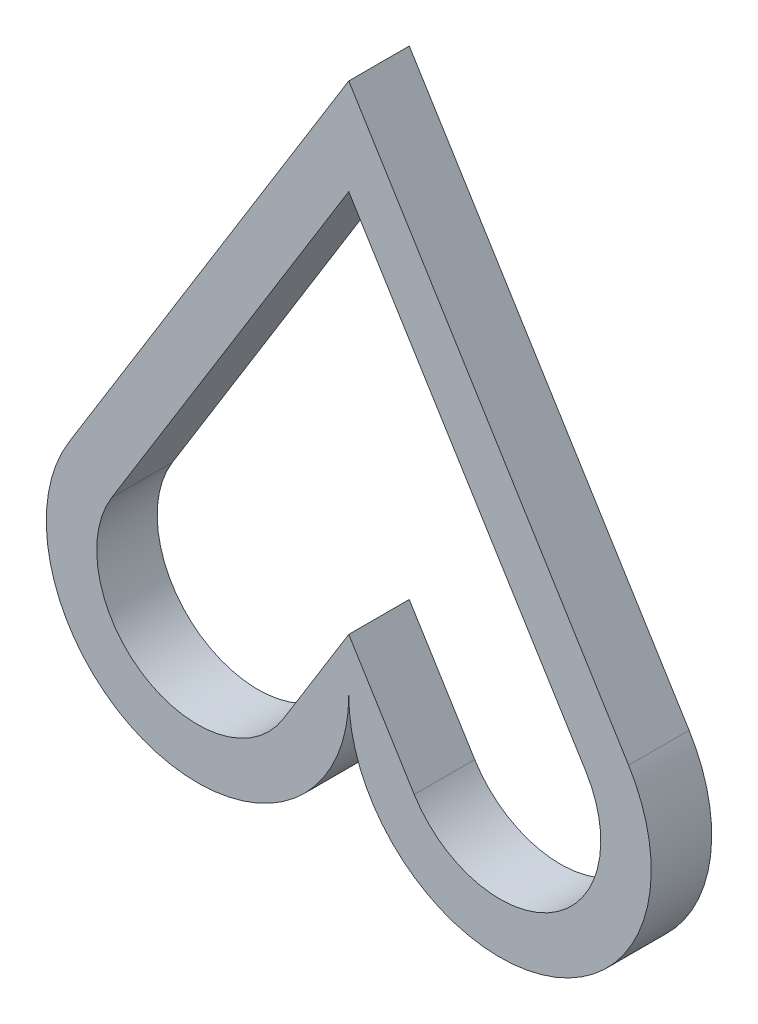
ISO-10303-21;
HEADER;
FILE_DESCRIPTION(('STEP AP214'),'2;1');
FILE_NAME('part.step','',(''),(''),'','','');
FILE_SCHEMA(('AUTOMOTIVE_DESIGN { 1 0 10303 214 1 1 1 1 }'));
ENDSEC;
DATA;
#1=APPLICATION_CONTEXT('core data for automotive mechanical design processes');
#2=APPLICATION_PROTOCOL_DEFINITION('international standard','automotive_design',2000,#1);
#3=PRODUCT_CONTEXT('',#1,'mechanical');
#4=PRODUCT('Part','Part','',(#3));
#5=PRODUCT_RELATED_PRODUCT_CATEGORY('part','',(#4));
#6=PRODUCT_DEFINITION_FORMATION('','',#4);
#7=PRODUCT_DEFINITION_CONTEXT('part definition',#1,'design');
#8=PRODUCT_DEFINITION('design','',#6,#7);
#9=PRODUCT_DEFINITION_SHAPE('','',#8);
#10=(LENGTH_UNIT() NAMED_UNIT(*) SI_UNIT(.MILLI.,.METRE.));
#11=(NAMED_UNIT(*) PLANE_ANGLE_UNIT() SI_UNIT($,.RADIAN.));
#12=(NAMED_UNIT(*) SI_UNIT($,.STERADIAN.) SOLID_ANGLE_UNIT());
#13=UNCERTAINTY_MEASURE_WITH_UNIT(LENGTH_MEASURE(1.E-05),#10,'distance_accuracy_value','');
#14=(GEOMETRIC_REPRESENTATION_CONTEXT(3) GLOBAL_UNCERTAINTY_ASSIGNED_CONTEXT((#13)) GLOBAL_UNIT_ASSIGNED_CONTEXT((#10,
#11,#12)) REPRESENTATION_CONTEXT('',''));
#15=CARTESIAN_POINT('',(0.,0.,0.));
#16=DIRECTION('',(0.,0.,1.));
#17=DIRECTION('',(1.,0.,0.));
#18=AXIS2_PLACEMENT_3D('',#15,#16,#17);
#19=CARTESIAN_POINT('',(-15.0005941465236,-52.7900822735894,-6.));
#20=DIRECTION('',(0.,0.,1.));
#21=DIRECTION('',(1.,0.,0.));
#22=AXIS2_PLACEMENT_3D('',#19,#20,#21);
#23=CYLINDRICAL_SURFACE('',#22,15.);
#24=CARTESIAN_POINT('',(-15.0005941465236,-52.7900822735894,0.));
#25=DIRECTION('',(0.,0.,1.));
#26=DIRECTION('',(1.,0.,0.));
#27=AXIS2_PLACEMENT_3D('',#24,#25,#26);
#28=CIRCLE('',#27,15.);
#29=CARTESIAN_POINT('',(-0.000594146523598404,-52.7900822735894,0.));
#30=VERTEX_POINT('',#29);
#31=CARTESIAN_POINT('',(-27.759328595598,-44.9024530189907,0.));
#32=VERTEX_POINT('',#31);
#33=EDGE_CURVE('E160',#30,#32,#28,.F.);
#34=ORIENTED_EDGE('',*,*,#33,.T.);
#35=DIRECTION('',(0.,0.,1.));
#36=VECTOR('',#35,1.);
#37=CARTESIAN_POINT('',(-27.759328595598,-44.9024530189907,-6.));
#38=LINE('',#37,#36);
#39=CARTESIAN_POINT('',(-27.759328595598,-44.9024530189907,-6.));
#40=VERTEX_POINT('',#39);
#41=EDGE_CURVE('E11',#40,#32,#38,.T.);
#42=ORIENTED_EDGE('',*,*,#41,.F.);
#43=CARTESIAN_POINT('',(-15.0005941465236,-52.7900822735894,-6.));
#44=DIRECTION('',(0.,0.,1.));
#45=DIRECTION('',(1.,0.,0.));
#46=AXIS2_PLACEMENT_3D('',#43,#44,#45);
#47=CIRCLE('',#46,15.);
#48=CARTESIAN_POINT('',(-0.000594146523598404,-52.7900822735894,-6.));
#49=VERTEX_POINT('',#48);
#50=EDGE_CURVE('E54',#49,#40,#47,.F.);
#51=ORIENTED_EDGE('',*,*,#50,.F.);
#52=DIRECTION('',(0.,0.,1.));
#53=VECTOR('',#52,1.);
#54=CARTESIAN_POINT('',(-0.000594146523598404,-52.7900822735894,-6.));
#55=LINE('',#54,#53);
#56=EDGE_CURVE('E134',#49,#30,#55,.T.);
#57=ORIENTED_EDGE('',*,*,#56,.T.);
#58=EDGE_LOOP('',(#34,#42,#51,#57));
#59=FACE_BOUND('',#58,.T.);
#60=ADVANCED_FACE('F35',(#59),#23,.T.);
#61=CARTESIAN_POINT('',(0.,0.,-6.));
#62=DIRECTION('',(-0.850582296604963,0.525841950306579,0.));
#63=DIRECTION('',(-0.525841950306579,-0.850582296604963,0.));
#64=AXIS2_PLACEMENT_3D('',#61,#62,#63);
#65=PLANE('',#64);
#66=DIRECTION('',(-0.525841950306579,-0.850582296604963,0.));
#67=VECTOR('',#66,1.);
#68=CARTESIAN_POINT('',(0.,0.,0.));
#69=LINE('',#68,#67);
#70=CARTESIAN_POINT('',(-0.000594146523600139,-0.000961069222927188,0.));
#71=VERTEX_POINT('',#70);
#72=EDGE_CURVE('E165',#71,#32,#69,.T.);
#73=ORIENTED_EDGE('',*,*,#72,.F.);
#74=DIRECTION('',(0.,0.,1.));
#75=VECTOR('',#74,1.);
#76=CARTESIAN_POINT('',(-0.000594146523600139,-0.000961069222927188,-6.));
#77=LINE('',#76,#75);
#78=CARTESIAN_POINT('',(-0.000594146523600139,-0.000961069222927188,-6.));
#79=VERTEX_POINT('',#78);
#80=EDGE_CURVE('E45',#79,#71,#77,.T.);
#81=ORIENTED_EDGE('',*,*,#80,.F.);
#82=DIRECTION('',(-0.525841950306579,-0.850582296604963,0.));
#83=VECTOR('',#82,1.);
#84=CARTESIAN_POINT('',(0.,0.,-6.));
#85=LINE('',#84,#83);
#86=EDGE_CURVE('E126',#79,#40,#85,.T.);
#87=ORIENTED_EDGE('',*,*,#86,.T.);
#88=ORIENTED_EDGE('',*,*,#41,.T.);
#89=EDGE_LOOP('',(#73,#81,#87,#88));
#90=FACE_BOUND('',#89,.T.);
#91=ADVANCED_FACE('F217',(#90),#65,.T.);
#92=CARTESIAN_POINT('',(-0.000859718425827981,-0.00053149003401119,-6.));
#93=DIRECTION('',(-0.850582296604963,-0.525841950306579,0.));
#94=DIRECTION('',(0.525841950306579,-0.850582296604963,0.));
#95=AXIS2_PLACEMENT_3D('',#92,#93,#94);
#96=PLANE('',#95);
#97=DIRECTION('',(0.525841950306579,-0.850582296604963,0.));
#98=VECTOR('',#97,1.);
#99=CARTESIAN_POINT('',(-0.000859718425827981,-0.00053149003401119,0.));
#100=LINE('',#99,#98);
#101=CARTESIAN_POINT('',(27.7581403025508,-44.9024530189907,0.));
#102=VERTEX_POINT('',#101);
#103=EDGE_CURVE('E130',#71,#102,#100,.T.);
#104=ORIENTED_EDGE('',*,*,#103,.T.);
#105=DIRECTION('',(0.,0.,1.));
#106=VECTOR('',#105,1.);
#107=CARTESIAN_POINT('',(27.7581403025508,-44.9024530189907,-6.));
#108=LINE('',#107,#106);
#109=CARTESIAN_POINT('',(27.7581403025508,-44.9024530189907,-6.));
#110=VERTEX_POINT('',#109);
#111=EDGE_CURVE('E128',#110,#102,#108,.T.);
#112=ORIENTED_EDGE('',*,*,#111,.F.);
#113=DIRECTION('',(0.525841950306579,-0.850582296604963,0.));
#114=VECTOR('',#113,1.);
#115=CARTESIAN_POINT('',(-0.000859718425827981,-0.00053149003401119,-6.));
#116=LINE('',#115,#114);
#117=EDGE_CURVE('E121',#79,#110,#116,.T.);
#118=ORIENTED_EDGE('',*,*,#117,.F.);
#119=ORIENTED_EDGE('',*,*,#80,.T.);
#120=EDGE_LOOP('',(#104,#112,#118,#119));
#121=FACE_BOUND('',#120,.T.);
#122=ADVANCED_FACE('F129',(#121),#96,.F.);
#123=CARTESIAN_POINT('',(14.9994058534764,-52.7900822735894,-6.));
#124=DIRECTION('',(0.,0.,1.));
#125=DIRECTION('',(1.,0.,0.));
#126=AXIS2_PLACEMENT_3D('',#123,#124,#125);
#127=CYLINDRICAL_SURFACE('',#126,10.);
#128=CARTESIAN_POINT('',(14.9994058534764,-52.7900822735894,0.));
#129=DIRECTION('',(0.,0.,1.));
#130=DIRECTION('',(1.,0.,0.));
#131=AXIS2_PLACEMENT_3D('',#128,#129,#130);
#132=CIRCLE('',#131,10.);
#133=CARTESIAN_POINT('',(6.49358288742418,-58.048501776651,0.));
#134=VERTEX_POINT('',#133);
#135=CARTESIAN_POINT('',(23.505228819526,-47.5316627705236,0.));
#136=VERTEX_POINT('',#135);
#137=EDGE_CURVE('E143',#134,#136,#132,.T.);
#138=ORIENTED_EDGE('',*,*,#137,.T.);
#139=DIRECTION('',(0.,0.,1.));
#140=VECTOR('',#139,1.);
#141=CARTESIAN_POINT('',(23.505228819526,-47.5316627705236,-6.));
#142=LINE('',#141,#140);
#143=CARTESIAN_POINT('',(23.505228819526,-47.5316627705236,-6.));
#144=VERTEX_POINT('',#143);
#145=EDGE_CURVE('E171',#144,#136,#142,.T.);
#146=ORIENTED_EDGE('',*,*,#145,.F.);
#147=CARTESIAN_POINT('',(14.9994058534764,-52.7900822735894,-6.));
#148=DIRECTION('',(0.,0.,1.));
#149=DIRECTION('',(1.,0.,0.));
#150=AXIS2_PLACEMENT_3D('',#147,#148,#149);
#151=CIRCLE('',#150,10.);
#152=CARTESIAN_POINT('',(6.49358288742418,-58.048501776651,-6.));
#153=VERTEX_POINT('',#152);
#154=EDGE_CURVE('E167',#153,#144,#151,.T.);
#155=ORIENTED_EDGE('',*,*,#154,.F.);
#156=DIRECTION('',(0.,0.,1.));
#157=VECTOR('',#156,1.);
#158=CARTESIAN_POINT('',(6.49358288742418,-58.048501776651,-6.));
#159=LINE('',#158,#157);
#160=EDGE_CURVE('E39',#153,#134,#159,.T.);
#161=ORIENTED_EDGE('',*,*,#160,.T.);
#162=EDGE_LOOP('',(#138,#146,#155,#161));
#163=FACE_BOUND('',#162,.T.);
#164=ADVANCED_FACE('F37',(#163),#127,.F.);
#165=CARTESIAN_POINT('',(-4.25377120139972,-2.62974124152835,-6.));
#166=DIRECTION('',(-0.850582296605596,-0.525841950305555,0.));
#167=DIRECTION('',(0.525841950305555,-0.850582296605596,0.));
#168=AXIS2_PLACEMENT_3D('',#165,#166,#167);
#169=PLANE('',#168);
#170=DIRECTION('',(0.525841950305555,-0.850582296605596,0.));
#171=VECTOR('',#170,1.);
#172=CARTESIAN_POINT('',(-4.25377120139972,-2.62974124152835,0.));
#173=LINE('',#172,#171);
#174=CARTESIAN_POINT('',(-0.000594146504882473,-9.50952157309095,0.));
#175=VERTEX_POINT('',#174);
#176=EDGE_CURVE('E157',#175,#136,#173,.T.);
#177=ORIENTED_EDGE('',*,*,#176,.F.);
#178=DIRECTION('',(0.,0.,1.));
#179=VECTOR('',#178,1.);
#180=CARTESIAN_POINT('',(-0.000594146504882473,-9.50952157309095,-6.));
#181=LINE('',#180,#179);
#182=CARTESIAN_POINT('',(-0.000594146504882473,-9.50952157309095,-6.));
#183=VERTEX_POINT('',#182);
#184=EDGE_CURVE('E173',#183,#175,#181,.T.);
#185=ORIENTED_EDGE('',*,*,#184,.F.);
#186=DIRECTION('',(0.525841950305555,-0.850582296605596,0.));
#187=VECTOR('',#186,1.);
#188=CARTESIAN_POINT('',(-4.25377120139972,-2.62974124152835,-6.));
#189=LINE('',#188,#187);
#190=EDGE_CURVE('E138',#183,#144,#189,.T.);
#191=ORIENTED_EDGE('',*,*,#190,.T.);
#192=ORIENTED_EDGE('',*,*,#145,.T.);
#193=EDGE_LOOP('',(#177,#185,#191,#192));
#194=FACE_BOUND('',#193,.T.);
#195=ADVANCED_FACE('F193',(#194),#169,.T.);
#196=CARTESIAN_POINT('',(4.252911483004,-2.62920975151714,-6.));
#197=DIRECTION('',(-0.850582296605222,0.525841950306161,0.));
#198=DIRECTION('',(-0.525841950306161,-0.850582296605222,0.));
#199=AXIS2_PLACEMENT_3D('',#196,#197,#198);
#200=PLANE('',#199);
#201=DIRECTION('',(-0.525841950306161,-0.850582296605222,0.));
#202=VECTOR('',#201,1.);
#203=CARTESIAN_POINT('',(4.252911483004,-2.62920975151714,0.));
#204=LINE('',#203,#202);
#205=CARTESIAN_POINT('',(-23.5064171125732,-47.5316627705236,0.));
#206=VERTEX_POINT('',#205);
#207=EDGE_CURVE('E154',#175,#206,#204,.T.);
#208=ORIENTED_EDGE('',*,*,#207,.T.);
#209=DIRECTION('',(0.,0.,1.));
#210=VECTOR('',#209,1.);
#211=CARTESIAN_POINT('',(-23.5064171125732,-47.5316627705236,-6.));
#212=LINE('',#211,#210);
#213=CARTESIAN_POINT('',(-23.5064171125732,-47.5316627705236,-6.));
#214=VERTEX_POINT('',#213);
#215=EDGE_CURVE('E175',#214,#206,#212,.T.);
#216=ORIENTED_EDGE('',*,*,#215,.F.);
#217=DIRECTION('',(-0.525841950306161,-0.850582296605222,0.));
#218=VECTOR('',#217,1.);
#219=CARTESIAN_POINT('',(4.252911483004,-2.62920975151714,-6.));
#220=LINE('',#219,#218);
#221=EDGE_CURVE('E197',#183,#214,#220,.T.);
#222=ORIENTED_EDGE('',*,*,#221,.F.);
#223=ORIENTED_EDGE('',*,*,#184,.T.);
#224=EDGE_LOOP('',(#208,#216,#222,#223));
#225=FACE_BOUND('',#224,.T.);
#226=ADVANCED_FACE('F228',(#225),#200,.F.);
#227=CARTESIAN_POINT('',(-15.0005941465236,-52.7900822735894,-6.));
#228=DIRECTION('',(0.,0.,1.));
#229=DIRECTION('',(1.,0.,0.));
#230=AXIS2_PLACEMENT_3D('',#227,#228,#229);
#231=CYLINDRICAL_SURFACE('',#230,10.);
#232=CARTESIAN_POINT('',(-15.0005941465236,-52.7900822735894,0.));
#233=DIRECTION('',(0.,0.,1.));
#234=DIRECTION('',(1.,0.,0.));
#235=AXIS2_PLACEMENT_3D('',#232,#233,#234);
#236=CIRCLE('',#235,10.);
#237=CARTESIAN_POINT('',(-6.49477118047138,-58.048501776651,0.));
#238=VERTEX_POINT('',#237);
#239=EDGE_CURVE('E151',#238,#206,#236,.F.);
#240=ORIENTED_EDGE('',*,*,#239,.F.);
#241=DIRECTION('',(0.,0.,1.));
#242=VECTOR('',#241,1.);
#243=CARTESIAN_POINT('',(-6.49477118047138,-58.048501776651,-6.));
#244=LINE('',#243,#242);
#245=CARTESIAN_POINT('',(-6.49477118047138,-58.048501776651,-6.));
#246=VERTEX_POINT('',#245);
#247=EDGE_CURVE('E177',#246,#238,#244,.T.);
#248=ORIENTED_EDGE('',*,*,#247,.F.);
#249=CARTESIAN_POINT('',(-15.0005941465236,-52.7900822735894,-6.));
#250=DIRECTION('',(0.,0.,1.));
#251=DIRECTION('',(1.,0.,0.));
#252=AXIS2_PLACEMENT_3D('',#249,#250,#251);
#253=CIRCLE('',#252,10.);
#254=EDGE_CURVE('E198',#246,#214,#253,.F.);
#255=ORIENTED_EDGE('',*,*,#254,.T.);
#256=ORIENTED_EDGE('',*,*,#215,.T.);
#257=EDGE_LOOP('',(#240,#248,#255,#256));
#258=FACE_BOUND('',#257,.T.);
#259=ADVANCED_FACE('F231',(#258),#231,.F.);
#260=CARTESIAN_POINT('',(21.2645574150941,-13.1460487576182,-6.));
#261=DIRECTION('',(-0.850582296605459,0.525841950305776,0.));
#262=DIRECTION('',(-0.525841950305776,-0.85058229660546,0.));
#263=AXIS2_PLACEMENT_3D('',#260,#261,#262);
#264=PLANE('',#263);
#265=DIRECTION('',(-0.525841950305776,-0.85058229660546,0.));
#266=VECTOR('',#265,1.);
#267=CARTESIAN_POINT('',(21.2645574150941,-13.1460487576182,0.));
#268=LINE('',#267,#266);
#269=CARTESIAN_POINT('',(-0.000594146518848732,-47.5437635888938,0.));
#270=VERTEX_POINT('',#269);
#271=EDGE_CURVE('E148',#270,#238,#268,.T.);
#272=ORIENTED_EDGE('',*,*,#271,.F.);
#273=DIRECTION('',(0.,0.,1.));
#274=VECTOR('',#273,1.);
#275=CARTESIAN_POINT('',(-0.000594146518848732,-47.5437635888938,-6.));
#276=LINE('',#275,#274);
#277=CARTESIAN_POINT('',(-0.000594146518848732,-47.5437635888938,-6.));
#278=VERTEX_POINT('',#277);
#279=EDGE_CURVE('E178',#278,#270,#276,.T.);
#280=ORIENTED_EDGE('',*,*,#279,.F.);
#281=DIRECTION('',(-0.525841950305776,-0.85058229660546,0.));
#282=VECTOR('',#281,1.);
#283=CARTESIAN_POINT('',(21.2645574150941,-13.1460487576182,-6.));
#284=LINE('',#283,#282);
#285=EDGE_CURVE('E203',#278,#246,#284,.T.);
#286=ORIENTED_EDGE('',*,*,#285,.T.);
#287=ORIENTED_EDGE('',*,*,#247,.T.);
#288=EDGE_LOOP('',(#272,#280,#286,#287));
#289=FACE_BOUND('',#288,.T.);
#290=ADVANCED_FACE('F235',(#289),#264,.T.);
#291=CARTESIAN_POINT('',(-21.2654171334991,-13.1465802476201,-6.));
#292=DIRECTION('',(-0.850582296605803,-0.525841950305219,0.));
#293=DIRECTION('',(0.525841950305219,-0.850582296605804,0.));
#294=AXIS2_PLACEMENT_3D('',#291,#292,#293);
#295=PLANE('',#294);
#296=DIRECTION('',(0.525841950305219,-0.850582296605804,0.));
#297=VECTOR('',#296,1.);
#298=CARTESIAN_POINT('',(-21.2654171334991,-13.1465802476201,0.));
#299=LINE('',#298,#297);
#300=EDGE_CURVE('E146',#270,#134,#299,.T.);
#301=ORIENTED_EDGE('',*,*,#300,.T.);
#302=ORIENTED_EDGE('',*,*,#160,.F.);
#303=DIRECTION('',(0.525841950305219,-0.850582296605804,0.));
#304=VECTOR('',#303,1.);
#305=CARTESIAN_POINT('',(-21.2654171334991,-13.1465802476201,-6.));
#306=LINE('',#305,#304);
#307=EDGE_CURVE('E102',#278,#153,#306,.T.);
#308=ORIENTED_EDGE('',*,*,#307,.F.);
#309=ORIENTED_EDGE('',*,*,#279,.T.);
#310=EDGE_LOOP('',(#301,#302,#308,#309));
#311=FACE_BOUND('',#310,.T.);
#312=ADVANCED_FACE('F214',(#311),#295,.F.);
#313=CARTESIAN_POINT('',(14.9994058534764,-52.7900822735894,-6.));
#314=DIRECTION('',(0.,0.,1.));
#315=DIRECTION('',(1.,0.,0.));
#316=AXIS2_PLACEMENT_3D('',#313,#314,#315);
#317=CYLINDRICAL_SURFACE('',#316,15.);
#318=CARTESIAN_POINT('',(14.9994058534764,-52.7900822735894,0.));
#319=DIRECTION('',(0.,0.,1.));
#320=DIRECTION('',(1.,0.,0.));
#321=AXIS2_PLACEMENT_3D('',#318,#319,#320);
#322=CIRCLE('',#321,15.);
#323=EDGE_CURVE('E162',#30,#102,#322,.T.);
#324=ORIENTED_EDGE('',*,*,#323,.F.);
#325=ORIENTED_EDGE('',*,*,#56,.F.);
#326=CARTESIAN_POINT('',(14.9994058534764,-52.7900822735894,-6.));
#327=DIRECTION('',(0.,0.,1.));
#328=DIRECTION('',(1.,0.,0.));
#329=AXIS2_PLACEMENT_3D('',#326,#327,#328);
#330=CIRCLE('',#329,15.);
#331=EDGE_CURVE('E125',#49,#110,#330,.T.);
#332=ORIENTED_EDGE('',*,*,#331,.T.);
#333=ORIENTED_EDGE('',*,*,#111,.T.);
#334=EDGE_LOOP('',(#324,#325,#332,#333));
#335=FACE_BOUND('',#334,.T.);
#336=ADVANCED_FACE('F136',(#335),#317,.T.);
#337=CARTESIAN_POINT('',(0.,0.,-6.));
#338=DIRECTION('',(0.,0.,1.));
#339=DIRECTION('',(1.,0.,0.));
#340=AXIS2_PLACEMENT_3D('',#337,#338,#339);
#341=PLANE('',#340);
#342=ORIENTED_EDGE('',*,*,#154,.T.);
#343=ORIENTED_EDGE('',*,*,#190,.F.);
#344=ORIENTED_EDGE('',*,*,#221,.T.);
#345=ORIENTED_EDGE('',*,*,#254,.F.);
#346=ORIENTED_EDGE('',*,*,#285,.F.);
#347=ORIENTED_EDGE('',*,*,#307,.T.);
#348=EDGE_LOOP('',(#342,#343,#344,#345,#346,#347));
#349=FACE_BOUND('',#348,.T.);
#350=ORIENTED_EDGE('',*,*,#50,.T.);
#351=ORIENTED_EDGE('',*,*,#86,.F.);
#352=ORIENTED_EDGE('',*,*,#117,.T.);
#353=ORIENTED_EDGE('',*,*,#331,.F.);
#354=EDGE_LOOP('',(#350,#351,#352,#353));
#355=FACE_BOUND('',#354,.T.);
#356=ADVANCED_FACE('F123',(#349,#355),#341,.F.);
#357=CARTESIAN_POINT('',(0.,0.,0.));
#358=DIRECTION('',(0.,0.,1.));
#359=DIRECTION('',(1.,0.,0.));
#360=AXIS2_PLACEMENT_3D('',#357,#358,#359);
#361=PLANE('',#360);
#362=ORIENTED_EDGE('',*,*,#137,.F.);
#363=ORIENTED_EDGE('',*,*,#300,.F.);
#364=ORIENTED_EDGE('',*,*,#271,.T.);
#365=ORIENTED_EDGE('',*,*,#239,.T.);
#366=ORIENTED_EDGE('',*,*,#207,.F.);
#367=ORIENTED_EDGE('',*,*,#176,.T.);
#368=EDGE_LOOP('',(#362,#363,#364,#365,#366,#367));
#369=FACE_BOUND('',#368,.T.);
#370=ORIENTED_EDGE('',*,*,#33,.F.);
#371=ORIENTED_EDGE('',*,*,#323,.T.);
#372=ORIENTED_EDGE('',*,*,#103,.F.);
#373=ORIENTED_EDGE('',*,*,#72,.T.);
#374=EDGE_LOOP('',(#370,#371,#372,#373));
#375=FACE_BOUND('',#374,.T.);
#376=ADVANCED_FACE('F187',(#369,#375),#361,.T.);
#377=CLOSED_SHELL('',(#60,#91,#122,#164,#195,#226,#259,#290,#312,#336,#356,#376));
#378=MANIFOLD_SOLID_BREP('B2',#377);
#379=ADVANCED_BREP_SHAPE_REPRESENTATION('',(#18,#378),#14);
#380=SHAPE_DEFINITION_REPRESENTATION(#9,#379);
ENDSEC;
END-ISO-10303-21;
